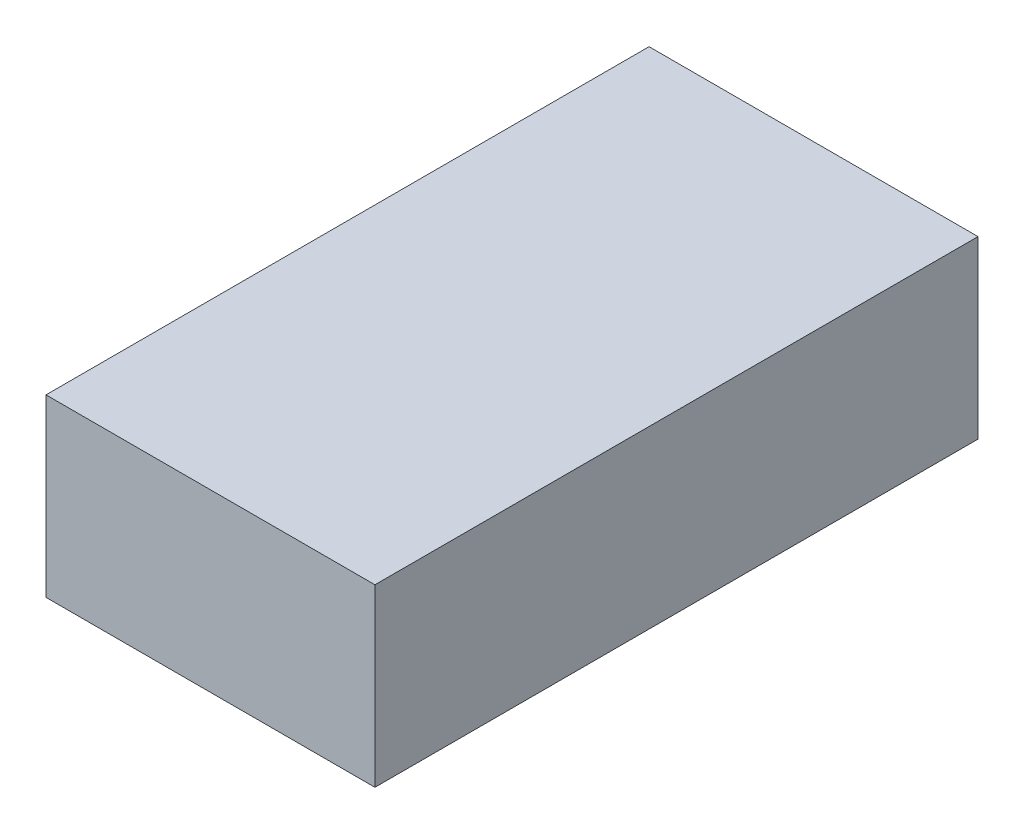
ISO-10303-21;
HEADER;
FILE_DESCRIPTION(('STEP AP214'),'2;1');
FILE_NAME('part.step','',(''),(''),'','','');
FILE_SCHEMA(('AUTOMOTIVE_DESIGN { 1 0 10303 214 1 1 1 1 }'));
ENDSEC;
DATA;
#1=APPLICATION_CONTEXT('core data for automotive mechanical design processes');
#2=APPLICATION_PROTOCOL_DEFINITION('international standard','automotive_design',2000,#1);
#3=PRODUCT_CONTEXT('',#1,'mechanical');
#4=PRODUCT('Part','Part','',(#3));
#5=PRODUCT_RELATED_PRODUCT_CATEGORY('part','',(#4));
#6=PRODUCT_DEFINITION_FORMATION('','',#4);
#7=PRODUCT_DEFINITION_CONTEXT('part definition',#1,'design');
#8=PRODUCT_DEFINITION('design','',#6,#7);
#9=PRODUCT_DEFINITION_SHAPE('','',#8);
#10=(LENGTH_UNIT() NAMED_UNIT(*) SI_UNIT(.MILLI.,.METRE.));
#11=(NAMED_UNIT(*) PLANE_ANGLE_UNIT() SI_UNIT($,.RADIAN.));
#12=(NAMED_UNIT(*) SI_UNIT($,.STERADIAN.) SOLID_ANGLE_UNIT());
#13=UNCERTAINTY_MEASURE_WITH_UNIT(LENGTH_MEASURE(1.E-05),#10,'distance_accuracy_value','');
#14=(GEOMETRIC_REPRESENTATION_CONTEXT(3) GLOBAL_UNCERTAINTY_ASSIGNED_CONTEXT((#13)) GLOBAL_UNIT_ASSIGNED_CONTEXT((#10,
#11,#12)) REPRESENTATION_CONTEXT('',''));
#15=CARTESIAN_POINT('',(0.,0.,0.));
#16=DIRECTION('',(0.,0.,1.));
#17=DIRECTION('',(1.,0.,0.));
#18=AXIS2_PLACEMENT_3D('',#15,#16,#17);
#19=CARTESIAN_POINT('',(32.8086610202558,16.,-20.9047952618988));
#20=DIRECTION('',(1.,0.,0.));
#21=DIRECTION('',(0.,0.,-1.));
#22=AXIS2_PLACEMENT_3D('',#19,#20,#21);
#23=PLANE('',#22);
#24=DIRECTION('',(0.,0.,1.));
#25=VECTOR('',#24,1.);
#26=CARTESIAN_POINT('',(32.8086610202558,0.,-20.9047952618988));
#27=LINE('',#26,#25);
#28=CARTESIAN_POINT('',(32.8086610202558,0.,-20.9047952618988));
#29=VERTEX_POINT('',#28);
#30=CARTESIAN_POINT('',(32.8086610202558,0.,34.0952047381012));
#31=VERTEX_POINT('',#30);
#32=EDGE_CURVE('E98',#29,#31,#27,.T.);
#33=ORIENTED_EDGE('',*,*,#32,.T.);
#34=DIRECTION('',(0.,-1.,0.));
#35=VECTOR('',#34,1.);
#36=CARTESIAN_POINT('',(32.8086610202558,16.,34.0952047381012));
#37=LINE('',#36,#35);
#38=CARTESIAN_POINT('',(32.8086610202558,16.,34.0952047381012));
#39=VERTEX_POINT('',#38);
#40=EDGE_CURVE('E11',#39,#31,#37,.T.);
#41=ORIENTED_EDGE('',*,*,#40,.F.);
#42=DIRECTION('',(0.,0.,1.));
#43=VECTOR('',#42,1.);
#44=CARTESIAN_POINT('',(32.8086610202558,16.,-20.9047952618988));
#45=LINE('',#44,#43);
#46=CARTESIAN_POINT('',(32.8086610202558,16.,-20.9047952618988));
#47=VERTEX_POINT('',#46);
#48=EDGE_CURVE('E86',#47,#39,#45,.T.);
#49=ORIENTED_EDGE('',*,*,#48,.F.);
#50=DIRECTION('',(0.,-1.,0.));
#51=VECTOR('',#50,1.);
#52=CARTESIAN_POINT('',(32.8086610202558,16.,-20.9047952618988));
#53=LINE('',#52,#51);
#54=EDGE_CURVE('E94',#47,#29,#53,.T.);
#55=ORIENTED_EDGE('',*,*,#54,.T.);
#56=EDGE_LOOP('',(#33,#41,#49,#55));
#57=FACE_BOUND('',#56,.T.);
#58=ADVANCED_FACE('F35',(#57),#23,.F.);
#59=CARTESIAN_POINT('',(32.8086610202558,16.,34.0952047381012));
#60=DIRECTION('',(0.,0.,-1.));
#61=DIRECTION('',(-1.,0.,0.));
#62=AXIS2_PLACEMENT_3D('',#59,#60,#61);
#63=PLANE('',#62);
#64=DIRECTION('',(1.,0.,0.));
#65=VECTOR('',#64,1.);
#66=CARTESIAN_POINT('',(32.8086610202558,0.,34.0952047381012));
#67=LINE('',#66,#65);
#68=CARTESIAN_POINT('',(62.8086610202558,0.,34.0952047381012));
#69=VERTEX_POINT('',#68);
#70=EDGE_CURVE('E90',#31,#69,#67,.T.);
#71=ORIENTED_EDGE('',*,*,#70,.T.);
#72=DIRECTION('',(0.,-1.,0.));
#73=VECTOR('',#72,1.);
#74=CARTESIAN_POINT('',(62.8086610202558,16.,34.0952047381012));
#75=LINE('',#74,#73);
#76=CARTESIAN_POINT('',(62.8086610202558,16.,34.0952047381012));
#77=VERTEX_POINT('',#76);
#78=EDGE_CURVE('E43',#77,#69,#75,.T.);
#79=ORIENTED_EDGE('',*,*,#78,.F.);
#80=DIRECTION('',(1.,0.,0.));
#81=VECTOR('',#80,1.);
#82=CARTESIAN_POINT('',(32.8086610202558,16.,34.0952047381012));
#83=LINE('',#82,#81);
#84=EDGE_CURVE('E81',#39,#77,#83,.T.);
#85=ORIENTED_EDGE('',*,*,#84,.F.);
#86=ORIENTED_EDGE('',*,*,#40,.T.);
#87=EDGE_LOOP('',(#71,#79,#85,#86));
#88=FACE_BOUND('',#87,.T.);
#89=ADVANCED_FACE('F89',(#88),#63,.F.);
#90=CARTESIAN_POINT('',(62.8086610202558,16.,-20.9047952618988));
#91=DIRECTION('',(-1.,0.,0.));
#92=DIRECTION('',(0.,0.,1.));
#93=AXIS2_PLACEMENT_3D('',#90,#91,#92);
#94=PLANE('',#93);
#95=DIRECTION('',(0.,0.,-1.));
#96=VECTOR('',#95,1.);
#97=CARTESIAN_POINT('',(62.8086610202558,0.,-20.9047952618988));
#98=LINE('',#97,#96);
#99=CARTESIAN_POINT('',(62.8086610202558,0.,-20.9047952618988));
#100=VERTEX_POINT('',#99);
#101=EDGE_CURVE('E68',#69,#100,#98,.T.);
#102=ORIENTED_EDGE('',*,*,#101,.T.);
#103=DIRECTION('',(0.,-1.,0.));
#104=VECTOR('',#103,1.);
#105=CARTESIAN_POINT('',(62.8086610202558,16.,-20.9047952618988));
#106=LINE('',#105,#104);
#107=CARTESIAN_POINT('',(62.8086610202558,16.,-20.9047952618988));
#108=VERTEX_POINT('',#107);
#109=EDGE_CURVE('E91',#108,#100,#106,.T.);
#110=ORIENTED_EDGE('',*,*,#109,.F.);
#111=DIRECTION('',(0.,0.,-1.));
#112=VECTOR('',#111,1.);
#113=CARTESIAN_POINT('',(62.8086610202558,16.,-20.9047952618988));
#114=LINE('',#113,#112);
#115=EDGE_CURVE('E84',#77,#108,#114,.T.);
#116=ORIENTED_EDGE('',*,*,#115,.F.);
#117=ORIENTED_EDGE('',*,*,#78,.T.);
#118=EDGE_LOOP('',(#102,#110,#116,#117));
#119=FACE_BOUND('',#118,.T.);
#120=ADVANCED_FACE('F92',(#119),#94,.F.);
#121=CARTESIAN_POINT('',(32.8086610202558,16.,-20.9047952618988));
#122=DIRECTION('',(0.,0.,1.));
#123=DIRECTION('',(1.,0.,0.));
#124=AXIS2_PLACEMENT_3D('',#121,#122,#123);
#125=PLANE('',#124);
#126=DIRECTION('',(-1.,0.,0.));
#127=VECTOR('',#126,1.);
#128=CARTESIAN_POINT('',(32.8086610202558,0.,-20.9047952618988));
#129=LINE('',#128,#127);
#130=EDGE_CURVE('E74',#100,#29,#129,.T.);
#131=ORIENTED_EDGE('',*,*,#130,.T.);
#132=ORIENTED_EDGE('',*,*,#54,.F.);
#133=DIRECTION('',(-1.,0.,0.));
#134=VECTOR('',#133,1.);
#135=CARTESIAN_POINT('',(32.8086610202558,16.,-20.9047952618988));
#136=LINE('',#135,#134);
#137=EDGE_CURVE('E51',#108,#47,#136,.T.);
#138=ORIENTED_EDGE('',*,*,#137,.F.);
#139=ORIENTED_EDGE('',*,*,#109,.T.);
#140=EDGE_LOOP('',(#131,#132,#138,#139));
#141=FACE_BOUND('',#140,.T.);
#142=ADVANCED_FACE('F105',(#141),#125,.F.);
#143=CARTESIAN_POINT('',(0.,16.,0.));
#144=DIRECTION('',(0.,1.,0.));
#145=DIRECTION('',(0.,0.,1.));
#146=AXIS2_PLACEMENT_3D('',#143,#144,#145);
#147=PLANE('',#146);
#148=ORIENTED_EDGE('',*,*,#48,.T.);
#149=ORIENTED_EDGE('',*,*,#84,.T.);
#150=ORIENTED_EDGE('',*,*,#115,.T.);
#151=ORIENTED_EDGE('',*,*,#137,.T.);
#152=EDGE_LOOP('',(#148,#149,#150,#151));
#153=FACE_BOUND('',#152,.T.);
#154=ADVANCED_FACE('F82',(#153),#147,.T.);
#155=CARTESIAN_POINT('',(0.,0.,0.));
#156=DIRECTION('',(0.,1.,0.));
#157=DIRECTION('',(0.,0.,1.));
#158=AXIS2_PLACEMENT_3D('',#155,#156,#157);
#159=PLANE('',#158);
#160=ORIENTED_EDGE('',*,*,#32,.F.);
#161=ORIENTED_EDGE('',*,*,#130,.F.);
#162=ORIENTED_EDGE('',*,*,#101,.F.);
#163=ORIENTED_EDGE('',*,*,#70,.F.);
#164=EDGE_LOOP('',(#160,#161,#162,#163));
#165=FACE_BOUND('',#164,.T.);
#166=ADVANCED_FACE('F108',(#165),#159,.F.);
#167=CLOSED_SHELL('',(#58,#89,#120,#142,#154,#166));
#168=MANIFOLD_SOLID_BREP('B2',#167);
#169=ADVANCED_BREP_SHAPE_REPRESENTATION('',(#18,#168),#14);
#170=SHAPE_DEFINITION_REPRESENTATION(#9,#169);
ENDSEC;
END-ISO-10303-21;
